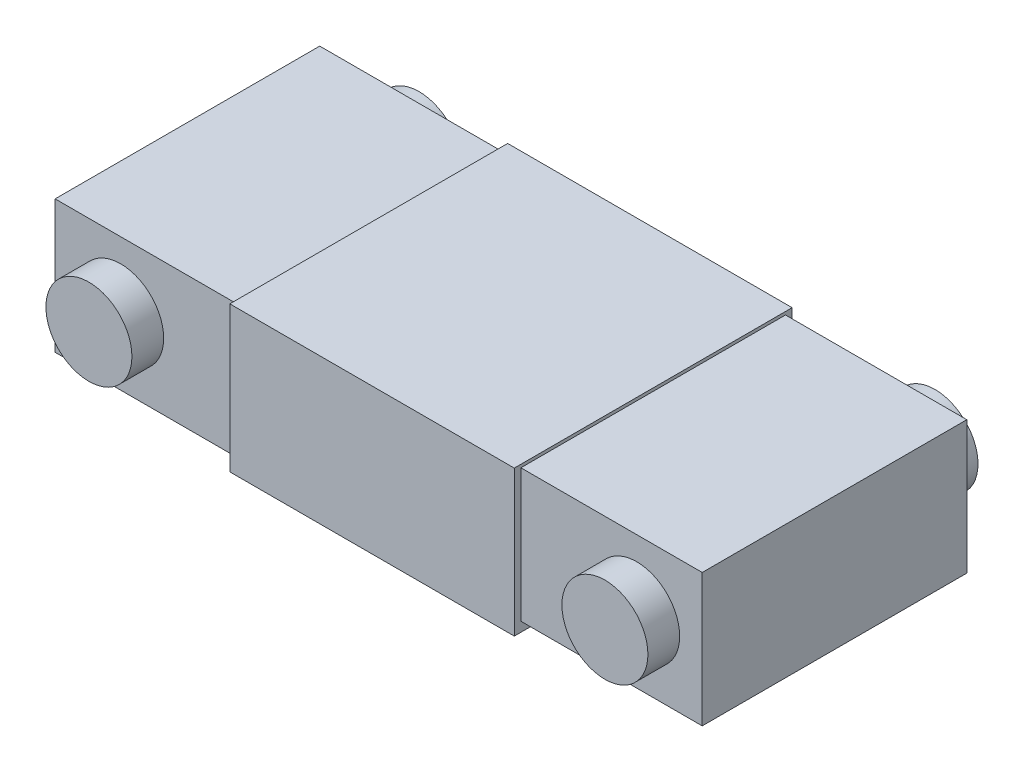
ISO-10303-21;
HEADER;
FILE_DESCRIPTION(('STEP AP214'),'2;1');
FILE_NAME('part.step','',(''),(''),'','','');
FILE_SCHEMA(('AUTOMOTIVE_DESIGN { 1 0 10303 214 1 1 1 1 }'));
ENDSEC;
DATA;
#1=APPLICATION_CONTEXT('core data for automotive mechanical design processes');
#2=APPLICATION_PROTOCOL_DEFINITION('international standard','automotive_design',2000,#1);
#3=PRODUCT_CONTEXT('',#1,'mechanical');
#4=PRODUCT('Part','Part','',(#3));
#5=PRODUCT_RELATED_PRODUCT_CATEGORY('part','',(#4));
#6=PRODUCT_DEFINITION_FORMATION('','',#4);
#7=PRODUCT_DEFINITION_CONTEXT('part definition',#1,'design');
#8=PRODUCT_DEFINITION('design','',#6,#7);
#9=PRODUCT_DEFINITION_SHAPE('','',#8);
#10=(LENGTH_UNIT() NAMED_UNIT(*) SI_UNIT(.MILLI.,.METRE.));
#11=(NAMED_UNIT(*) PLANE_ANGLE_UNIT() SI_UNIT($,.RADIAN.));
#12=(NAMED_UNIT(*) SI_UNIT($,.STERADIAN.) SOLID_ANGLE_UNIT());
#13=UNCERTAINTY_MEASURE_WITH_UNIT(LENGTH_MEASURE(1.E-05),#10,'distance_accuracy_value','');
#14=(GEOMETRIC_REPRESENTATION_CONTEXT(3) GLOBAL_UNCERTAINTY_ASSIGNED_CONTEXT((#13)) GLOBAL_UNIT_ASSIGNED_CONTEXT((#10,
#11,#12)) REPRESENTATION_CONTEXT('',''));
#15=CARTESIAN_POINT('',(0.,0.,0.));
#16=DIRECTION('',(0.,0.,1.));
#17=DIRECTION('',(1.,0.,0.));
#18=AXIS2_PLACEMENT_3D('',#15,#16,#17);
#19=CARTESIAN_POINT('',(0.,0.,20.));
#20=DIRECTION('',(0.,0.,1.));
#21=DIRECTION('',(1.,0.,0.));
#22=AXIS2_PLACEMENT_3D('',#19,#20,#21);
#23=PLANE('',#22);
#24=CARTESIAN_POINT('',(78.,0.,20.));
#25=DIRECTION('',(0.,0.,1.));
#26=DIRECTION('',(1.,0.,0.));
#27=AXIS2_PLACEMENT_3D('',#24,#25,#26);
#28=CIRCLE('',#27,6.5);
#29=CARTESIAN_POINT('',(84.5,0.,20.));
#30=VERTEX_POINT('',#29);
#31=EDGE_CURVE('E11',#30,#30,#28,.T.);
#32=ORIENTED_EDGE('',*,*,#31,.F.);
#33=EDGE_LOOP('',(#32));
#34=FACE_BOUND('',#33,.T.);
#35=DIRECTION('',(-1.,0.,0.));
#36=VECTOR('',#35,1.);
#37=CARTESIAN_POINT('',(87.91,10.045,20.));
#38=LINE('',#37,#36);
#39=CARTESIAN_POINT('',(87.91,10.045,20.));
#40=VERTEX_POINT('',#39);
#41=CARTESIAN_POINT('',(60.5,10.045,20.));
#42=VERTEX_POINT('',#41);
#43=EDGE_CURVE('E113',#40,#42,#38,.T.);
#44=ORIENTED_EDGE('',*,*,#43,.T.);
#45=DIRECTION('',(0.,-1.,0.));
#46=VECTOR('',#45,1.);
#47=CARTESIAN_POINT('',(60.5,0.,20.));
#48=LINE('',#47,#46);
#49=CARTESIAN_POINT('',(60.5,-10.045,20.));
#50=VERTEX_POINT('',#49);
#51=EDGE_CURVE('E116',#42,#50,#48,.T.);
#52=ORIENTED_EDGE('',*,*,#51,.T.);
#53=DIRECTION('',(1.,0.,0.));
#54=VECTOR('',#53,1.);
#55=CARTESIAN_POINT('',(87.91,-10.045,20.));
#56=LINE('',#55,#54);
#57=CARTESIAN_POINT('',(87.91,-10.045,20.));
#58=VERTEX_POINT('',#57);
#59=EDGE_CURVE('E157',#50,#58,#56,.T.);
#60=ORIENTED_EDGE('',*,*,#59,.T.);
#61=DIRECTION('',(0.,1.,0.));
#62=VECTOR('',#61,1.);
#63=CARTESIAN_POINT('',(87.91,10.045,20.));
#64=LINE('',#63,#62);
#65=EDGE_CURVE('E119',#58,#40,#64,.T.);
#66=ORIENTED_EDGE('',*,*,#65,.T.);
#67=EDGE_LOOP('',(#44,#52,#60,#66));
#68=FACE_BOUND('',#67,.T.);
#69=ADVANCED_FACE('F43',(#34,#68),#23,.T.);
#70=CARTESIAN_POINT('',(0.,0.,20.));
#71=DIRECTION('',(0.,0.,1.));
#72=DIRECTION('',(1.,0.,0.));
#73=AXIS2_PLACEMENT_3D('',#70,#71,#72);
#74=CIRCLE('',#73,6.5);
#75=CARTESIAN_POINT('',(6.5,0.,20.));
#76=VERTEX_POINT('',#75);
#77=EDGE_CURVE('E54',#76,#76,#74,.T.);
#78=ORIENTED_EDGE('',*,*,#77,.F.);
#79=EDGE_LOOP('',(#78));
#80=FACE_BOUND('',#79,.T.);
#81=DIRECTION('',(1.,0.,0.));
#82=VECTOR('',#81,1.);
#83=CARTESIAN_POINT('',(-9.91,-10.045,20.));
#84=LINE('',#83,#82);
#85=CARTESIAN_POINT('',(-9.91,-10.045,20.));
#86=VERTEX_POINT('',#85);
#87=CARTESIAN_POINT('',(17.5,-10.045,20.));
#88=VERTEX_POINT('',#87);
#89=EDGE_CURVE('E97',#86,#88,#84,.T.);
#90=ORIENTED_EDGE('',*,*,#89,.T.);
#91=DIRECTION('',(0.,1.,0.));
#92=VECTOR('',#91,1.);
#93=CARTESIAN_POINT('',(17.5,0.,20.));
#94=LINE('',#93,#92);
#95=CARTESIAN_POINT('',(17.5,10.045,20.));
#96=VERTEX_POINT('',#95);
#97=EDGE_CURVE('E141',#88,#96,#94,.T.);
#98=ORIENTED_EDGE('',*,*,#97,.T.);
#99=DIRECTION('',(-1.,0.,0.));
#100=VECTOR('',#99,1.);
#101=CARTESIAN_POINT('',(-9.91,10.045,20.));
#102=LINE('',#101,#100);
#103=CARTESIAN_POINT('',(-9.91,10.045,20.));
#104=VERTEX_POINT('',#103);
#105=EDGE_CURVE('E63',#96,#104,#102,.T.);
#106=ORIENTED_EDGE('',*,*,#105,.T.);
#107=DIRECTION('',(0.,-1.,0.));
#108=VECTOR('',#107,1.);
#109=CARTESIAN_POINT('',(-9.91,10.045,20.));
#110=LINE('',#109,#108);
#111=EDGE_CURVE('E152',#104,#86,#110,.T.);
#112=ORIENTED_EDGE('',*,*,#111,.T.);
#113=EDGE_LOOP('',(#90,#98,#106,#112));
#114=FACE_BOUND('',#113,.T.);
#115=ADVANCED_FACE('F318',(#80,#114),#23,.T.);
#116=CARTESIAN_POINT('',(0.,0.,-20.));
#117=DIRECTION('',(0.,0.,1.));
#118=DIRECTION('',(1.,0.,0.));
#119=AXIS2_PLACEMENT_3D('',#116,#117,#118);
#120=PLANE('',#119);
#121=CARTESIAN_POINT('',(78.,0.,-20.));
#122=DIRECTION('',(0.,0.,1.));
#123=DIRECTION('',(1.,0.,0.));
#124=AXIS2_PLACEMENT_3D('',#121,#122,#123);
#125=CIRCLE('',#124,6.5);
#126=CARTESIAN_POINT('',(84.5,0.,-20.));
#127=VERTEX_POINT('',#126);
#128=EDGE_CURVE('E47',#127,#127,#125,.T.);
#129=ORIENTED_EDGE('',*,*,#128,.T.);
#130=EDGE_LOOP('',(#129));
#131=FACE_BOUND('',#130,.T.);
#132=DIRECTION('',(0.,-1.,0.));
#133=VECTOR('',#132,1.);
#134=CARTESIAN_POINT('',(60.5,0.,-20.));
#135=LINE('',#134,#133);
#136=CARTESIAN_POINT('',(60.5,10.045,-20.));
#137=VERTEX_POINT('',#136);
#138=CARTESIAN_POINT('',(60.5,-10.045,-20.));
#139=VERTEX_POINT('',#138);
#140=EDGE_CURVE('E215',#137,#139,#135,.T.);
#141=ORIENTED_EDGE('',*,*,#140,.F.);
#142=DIRECTION('',(-1.,0.,0.));
#143=VECTOR('',#142,1.);
#144=CARTESIAN_POINT('',(87.91,10.045,-20.));
#145=LINE('',#144,#143);
#146=CARTESIAN_POINT('',(87.91,10.045,-20.));
#147=VERTEX_POINT('',#146);
#148=EDGE_CURVE('E128',#147,#137,#145,.T.);
#149=ORIENTED_EDGE('',*,*,#148,.F.);
#150=DIRECTION('',(0.,1.,0.));
#151=VECTOR('',#150,1.);
#152=CARTESIAN_POINT('',(87.91,10.045,-20.));
#153=LINE('',#152,#151);
#154=CARTESIAN_POINT('',(87.91,-10.045,-20.));
#155=VERTEX_POINT('',#154);
#156=EDGE_CURVE('E81',#155,#147,#153,.T.);
#157=ORIENTED_EDGE('',*,*,#156,.F.);
#158=DIRECTION('',(1.,0.,0.));
#159=VECTOR('',#158,1.);
#160=CARTESIAN_POINT('',(87.91,-10.045,-20.));
#161=LINE('',#160,#159);
#162=EDGE_CURVE('E168',#139,#155,#161,.T.);
#163=ORIENTED_EDGE('',*,*,#162,.F.);
#164=EDGE_LOOP('',(#141,#149,#157,#163));
#165=FACE_BOUND('',#164,.T.);
#166=ADVANCED_FACE('F302',(#131,#165),#120,.F.);
#167=CARTESIAN_POINT('',(0.,0.,-20.));
#168=DIRECTION('',(0.,0.,1.));
#169=DIRECTION('',(1.,0.,0.));
#170=AXIS2_PLACEMENT_3D('',#167,#168,#169);
#171=CIRCLE('',#170,6.5);
#172=CARTESIAN_POINT('',(6.5,0.,-20.));
#173=VERTEX_POINT('',#172);
#174=EDGE_CURVE('E217',#173,#173,#171,.T.);
#175=ORIENTED_EDGE('',*,*,#174,.T.);
#176=EDGE_LOOP('',(#175));
#177=FACE_BOUND('',#176,.T.);
#178=DIRECTION('',(0.,1.,0.));
#179=VECTOR('',#178,1.);
#180=CARTESIAN_POINT('',(17.5,0.,-20.));
#181=LINE('',#180,#179);
#182=CARTESIAN_POINT('',(17.5,-10.045,-20.));
#183=VERTEX_POINT('',#182);
#184=CARTESIAN_POINT('',(17.5,10.045,-20.));
#185=VERTEX_POINT('',#184);
#186=EDGE_CURVE('E211',#183,#185,#181,.T.);
#187=ORIENTED_EDGE('',*,*,#186,.F.);
#188=DIRECTION('',(1.,0.,0.));
#189=VECTOR('',#188,1.);
#190=CARTESIAN_POINT('',(-9.91,-10.045,-20.));
#191=LINE('',#190,#189);
#192=CARTESIAN_POINT('',(-9.91,-10.045,-20.));
#193=VERTEX_POINT('',#192);
#194=EDGE_CURVE('E146',#193,#183,#191,.T.);
#195=ORIENTED_EDGE('',*,*,#194,.F.);
#196=DIRECTION('',(0.,-1.,0.));
#197=VECTOR('',#196,1.);
#198=CARTESIAN_POINT('',(-9.91,10.045,-20.));
#199=LINE('',#198,#197);
#200=CARTESIAN_POINT('',(-9.91,10.045,-20.));
#201=VERTEX_POINT('',#200);
#202=EDGE_CURVE('E140',#201,#193,#199,.T.);
#203=ORIENTED_EDGE('',*,*,#202,.F.);
#204=DIRECTION('',(-1.,0.,0.));
#205=VECTOR('',#204,1.);
#206=CARTESIAN_POINT('',(-9.91,10.045,-20.));
#207=LINE('',#206,#205);
#208=EDGE_CURVE('E88',#185,#201,#207,.T.);
#209=ORIENTED_EDGE('',*,*,#208,.F.);
#210=EDGE_LOOP('',(#187,#195,#203,#209));
#211=FACE_BOUND('',#210,.T.);
#212=ADVANCED_FACE('F332',(#177,#211),#120,.F.);
#213=CARTESIAN_POINT('',(-9.91,10.045,20.));
#214=DIRECTION('',(1.,0.,0.));
#215=DIRECTION('',(0.,1.,0.));
#216=AXIS2_PLACEMENT_3D('',#213,#214,#215);
#217=PLANE('',#216);
#218=ORIENTED_EDGE('',*,*,#202,.T.);
#219=DIRECTION('',(0.,0.,-1.));
#220=VECTOR('',#219,1.);
#221=CARTESIAN_POINT('',(-9.91,-10.045,20.));
#222=LINE('',#221,#220);
#223=EDGE_CURVE('E208',#86,#193,#222,.T.);
#224=ORIENTED_EDGE('',*,*,#223,.F.);
#225=ORIENTED_EDGE('',*,*,#111,.F.);
#226=DIRECTION('',(0.,0.,-1.));
#227=VECTOR('',#226,1.);
#228=CARTESIAN_POINT('',(-9.91,10.045,20.));
#229=LINE('',#228,#227);
#230=EDGE_CURVE('E163',#104,#201,#229,.T.);
#231=ORIENTED_EDGE('',*,*,#230,.T.);
#232=EDGE_LOOP('',(#218,#224,#225,#231));
#233=FACE_BOUND('',#232,.T.);
#234=ADVANCED_FACE('F45',(#233),#217,.F.);
#235=CARTESIAN_POINT('',(-9.91,-10.045,20.));
#236=DIRECTION('',(0.,1.,0.));
#237=DIRECTION('',(-1.,0.,0.));
#238=AXIS2_PLACEMENT_3D('',#235,#236,#237);
#239=PLANE('',#238);
#240=ORIENTED_EDGE('',*,*,#194,.T.);
#241=DIRECTION('',(0.,0.,-1.));
#242=VECTOR('',#241,1.);
#243=CARTESIAN_POINT('',(17.5,-10.045,20.));
#244=LINE('',#243,#242);
#245=EDGE_CURVE('E204',#88,#183,#244,.T.);
#246=ORIENTED_EDGE('',*,*,#245,.F.);
#247=ORIENTED_EDGE('',*,*,#89,.F.);
#248=ORIENTED_EDGE('',*,*,#223,.T.);
#249=EDGE_LOOP('',(#240,#246,#247,#248));
#250=FACE_BOUND('',#249,.T.);
#251=ADVANCED_FACE('F497',(#250),#239,.F.);
#252=CARTESIAN_POINT('',(60.5,-11.495,20.));
#253=DIRECTION('',(0.,1.,0.));
#254=DIRECTION('',(-1.,0.,0.));
#255=AXIS2_PLACEMENT_3D('',#252,#253,#254);
#256=PLANE('',#255);
#257=DIRECTION('',(0.,0.,-1.));
#258=VECTOR('',#257,1.);
#259=CARTESIAN_POINT('',(17.5,-11.495,20.));
#260=LINE('',#259,#258);
#261=CARTESIAN_POINT('',(17.5,-11.495,21.));
#262=VERTEX_POINT('',#261);
#263=CARTESIAN_POINT('',(17.5,-11.495,-21.));
#264=VERTEX_POINT('',#263);
#265=EDGE_CURVE('E200',#262,#264,#260,.T.);
#266=ORIENTED_EDGE('',*,*,#265,.T.);
#267=DIRECTION('',(1.,0.,0.));
#268=VECTOR('',#267,1.);
#269=CARTESIAN_POINT('',(17.5,-11.495,-21.));
#270=LINE('',#269,#268);
#271=CARTESIAN_POINT('',(60.5,-11.495,-21.));
#272=VERTEX_POINT('',#271);
#273=EDGE_CURVE('E246',#264,#272,#270,.T.);
#274=ORIENTED_EDGE('',*,*,#273,.T.);
#275=DIRECTION('',(0.,0.,-1.));
#276=VECTOR('',#275,1.);
#277=CARTESIAN_POINT('',(60.5,-11.495,20.));
#278=LINE('',#277,#276);
#279=CARTESIAN_POINT('',(60.5,-11.495,21.));
#280=VERTEX_POINT('',#279);
#281=EDGE_CURVE('E196',#280,#272,#278,.T.);
#282=ORIENTED_EDGE('',*,*,#281,.F.);
#283=DIRECTION('',(1.,0.,0.));
#284=VECTOR('',#283,1.);
#285=CARTESIAN_POINT('',(17.5,-11.495,21.));
#286=LINE('',#285,#284);
#287=EDGE_CURVE('E148',#262,#280,#286,.T.);
#288=ORIENTED_EDGE('',*,*,#287,.F.);
#289=EDGE_LOOP('',(#266,#274,#282,#288));
#290=FACE_BOUND('',#289,.T.);
#291=ADVANCED_FACE('F270',(#290),#256,.F.);
#292=CARTESIAN_POINT('',(87.91,-10.045,20.));
#293=DIRECTION('',(0.,1.,0.));
#294=DIRECTION('',(-1.,0.,0.));
#295=AXIS2_PLACEMENT_3D('',#292,#293,#294);
#296=PLANE('',#295);
#297=ORIENTED_EDGE('',*,*,#162,.T.);
#298=DIRECTION('',(0.,0.,-1.));
#299=VECTOR('',#298,1.);
#300=CARTESIAN_POINT('',(87.91,-10.045,20.));
#301=LINE('',#300,#299);
#302=EDGE_CURVE('E191',#58,#155,#301,.T.);
#303=ORIENTED_EDGE('',*,*,#302,.F.);
#304=ORIENTED_EDGE('',*,*,#59,.F.);
#305=DIRECTION('',(0.,0.,-1.));
#306=VECTOR('',#305,1.);
#307=CARTESIAN_POINT('',(60.5,-10.045,20.));
#308=LINE('',#307,#306);
#309=EDGE_CURVE('E137',#50,#139,#308,.T.);
#310=ORIENTED_EDGE('',*,*,#309,.T.);
#311=EDGE_LOOP('',(#297,#303,#304,#310));
#312=FACE_BOUND('',#311,.T.);
#313=ADVANCED_FACE('F305',(#312),#296,.F.);
#314=CARTESIAN_POINT('',(87.91,10.045,20.));
#315=DIRECTION('',(-1.,0.,0.));
#316=DIRECTION('',(0.,-1.,0.));
#317=AXIS2_PLACEMENT_3D('',#314,#315,#316);
#318=PLANE('',#317);
#319=ORIENTED_EDGE('',*,*,#156,.T.);
#320=DIRECTION('',(0.,0.,-1.));
#321=VECTOR('',#320,1.);
#322=CARTESIAN_POINT('',(87.91,10.045,20.));
#323=LINE('',#322,#321);
#324=EDGE_CURVE('E132',#40,#147,#323,.T.);
#325=ORIENTED_EDGE('',*,*,#324,.F.);
#326=ORIENTED_EDGE('',*,*,#65,.F.);
#327=ORIENTED_EDGE('',*,*,#302,.T.);
#328=EDGE_LOOP('',(#319,#325,#326,#327));
#329=FACE_BOUND('',#328,.T.);
#330=ADVANCED_FACE('F306',(#329),#318,.F.);
#331=CARTESIAN_POINT('',(87.91,10.045,20.));
#332=DIRECTION('',(0.,-1.,0.));
#333=DIRECTION('',(1.,0.,0.));
#334=AXIS2_PLACEMENT_3D('',#331,#332,#333);
#335=PLANE('',#334);
#336=ORIENTED_EDGE('',*,*,#148,.T.);
#337=DIRECTION('',(0.,0.,-1.));
#338=VECTOR('',#337,1.);
#339=CARTESIAN_POINT('',(60.5,10.045,20.));
#340=LINE('',#339,#338);
#341=EDGE_CURVE('E125',#42,#137,#340,.T.);
#342=ORIENTED_EDGE('',*,*,#341,.F.);
#343=ORIENTED_EDGE('',*,*,#43,.F.);
#344=ORIENTED_EDGE('',*,*,#324,.T.);
#345=EDGE_LOOP('',(#336,#342,#343,#344));
#346=FACE_BOUND('',#345,.T.);
#347=ADVANCED_FACE('F126',(#346),#335,.F.);
#348=CARTESIAN_POINT('',(60.5,10.505,20.));
#349=DIRECTION('',(-1.,0.,0.));
#350=DIRECTION('',(0.,-1.,0.));
#351=AXIS2_PLACEMENT_3D('',#348,#349,#350);
#352=PLANE('',#351);
#353=DIRECTION('',(0.,0.,-1.));
#354=VECTOR('',#353,1.);
#355=CARTESIAN_POINT('',(60.5,10.505,20.));
#356=LINE('',#355,#354);
#357=CARTESIAN_POINT('',(60.5,10.505,21.));
#358=VERTEX_POINT('',#357);
#359=CARTESIAN_POINT('',(60.5,10.505,-21.));
#360=VERTEX_POINT('',#359);
#361=EDGE_CURVE('E133',#358,#360,#356,.T.);
#362=ORIENTED_EDGE('',*,*,#361,.F.);
#363=DIRECTION('',(0.,1.,0.));
#364=VECTOR('',#363,1.);
#365=CARTESIAN_POINT('',(60.5,-11.495,21.));
#366=LINE('',#365,#364);
#367=EDGE_CURVE('E241',#280,#358,#366,.T.);
#368=ORIENTED_EDGE('',*,*,#367,.F.);
#369=ORIENTED_EDGE('',*,*,#281,.T.);
#370=DIRECTION('',(0.,1.,0.));
#371=VECTOR('',#370,1.);
#372=CARTESIAN_POINT('',(60.5,-11.495,-21.));
#373=LINE('',#372,#371);
#374=EDGE_CURVE('E220',#272,#360,#373,.T.);
#375=ORIENTED_EDGE('',*,*,#374,.T.);
#376=EDGE_LOOP('',(#362,#368,#369,#375));
#377=FACE_BOUND('',#376,.T.);
#378=ORIENTED_EDGE('',*,*,#341,.T.);
#379=ORIENTED_EDGE('',*,*,#140,.T.);
#380=ORIENTED_EDGE('',*,*,#309,.F.);
#381=ORIENTED_EDGE('',*,*,#51,.F.);
#382=EDGE_LOOP('',(#378,#379,#380,#381));
#383=FACE_BOUND('',#382,.T.);
#384=ADVANCED_FACE('F135',(#377,#383),#352,.F.);
#385=CARTESIAN_POINT('',(60.5,10.505,20.));
#386=DIRECTION('',(0.,-1.,0.));
#387=DIRECTION('',(1.,0.,0.));
#388=AXIS2_PLACEMENT_3D('',#385,#386,#387);
#389=PLANE('',#388);
#390=ORIENTED_EDGE('',*,*,#361,.T.);
#391=DIRECTION('',(-1.,0.,0.));
#392=VECTOR('',#391,1.);
#393=CARTESIAN_POINT('',(60.5,10.505,-21.));
#394=LINE('',#393,#392);
#395=CARTESIAN_POINT('',(17.5,10.505,-21.));
#396=VERTEX_POINT('',#395);
#397=EDGE_CURVE('E227',#360,#396,#394,.T.);
#398=ORIENTED_EDGE('',*,*,#397,.T.);
#399=DIRECTION('',(0.,0.,-1.));
#400=VECTOR('',#399,1.);
#401=CARTESIAN_POINT('',(17.5,10.505,20.));
#402=LINE('',#401,#400);
#403=CARTESIAN_POINT('',(17.5,10.505,21.));
#404=VERTEX_POINT('',#403);
#405=EDGE_CURVE('E182',#404,#396,#402,.T.);
#406=ORIENTED_EDGE('',*,*,#405,.F.);
#407=DIRECTION('',(-1.,0.,0.));
#408=VECTOR('',#407,1.);
#409=CARTESIAN_POINT('',(60.5,10.505,21.));
#410=LINE('',#409,#408);
#411=EDGE_CURVE('E245',#358,#404,#410,.T.);
#412=ORIENTED_EDGE('',*,*,#411,.F.);
#413=EDGE_LOOP('',(#390,#398,#406,#412));
#414=FACE_BOUND('',#413,.T.);
#415=ADVANCED_FACE('F340',(#414),#389,.F.);
#416=CARTESIAN_POINT('',(17.5,10.505,20.));
#417=DIRECTION('',(1.,0.,0.));
#418=DIRECTION('',(0.,1.,0.));
#419=AXIS2_PLACEMENT_3D('',#416,#417,#418);
#420=PLANE('',#419);
#421=ORIENTED_EDGE('',*,*,#265,.F.);
#422=DIRECTION('',(0.,-1.,0.));
#423=VECTOR('',#422,1.);
#424=CARTESIAN_POINT('',(17.5,10.505,21.));
#425=LINE('',#424,#423);
#426=EDGE_CURVE('E250',#404,#262,#425,.T.);
#427=ORIENTED_EDGE('',*,*,#426,.F.);
#428=ORIENTED_EDGE('',*,*,#405,.T.);
#429=DIRECTION('',(0.,-1.,0.));
#430=VECTOR('',#429,1.);
#431=CARTESIAN_POINT('',(17.5,10.505,-21.));
#432=LINE('',#431,#430);
#433=EDGE_CURVE('E260',#396,#264,#432,.T.);
#434=ORIENTED_EDGE('',*,*,#433,.T.);
#435=EDGE_LOOP('',(#421,#427,#428,#434));
#436=FACE_BOUND('',#435,.T.);
#437=ORIENTED_EDGE('',*,*,#97,.F.);
#438=ORIENTED_EDGE('',*,*,#245,.T.);
#439=ORIENTED_EDGE('',*,*,#186,.T.);
#440=DIRECTION('',(0.,0.,-1.));
#441=VECTOR('',#440,1.);
#442=CARTESIAN_POINT('',(17.5,10.045,20.));
#443=LINE('',#442,#441);
#444=EDGE_CURVE('E179',#96,#185,#443,.T.);
#445=ORIENTED_EDGE('',*,*,#444,.F.);
#446=EDGE_LOOP('',(#437,#438,#439,#445));
#447=FACE_BOUND('',#446,.T.);
#448=ADVANCED_FACE('F337',(#436,#447),#420,.F.);
#449=CARTESIAN_POINT('',(-9.91,10.045,20.));
#450=DIRECTION('',(0.,-1.,0.));
#451=DIRECTION('',(0.,0.,-1.));
#452=AXIS2_PLACEMENT_3D('',#449,#450,#451);
#453=PLANE('',#452);
#454=ORIENTED_EDGE('',*,*,#208,.T.);
#455=ORIENTED_EDGE('',*,*,#230,.F.);
#456=ORIENTED_EDGE('',*,*,#105,.F.);
#457=ORIENTED_EDGE('',*,*,#444,.T.);
#458=EDGE_LOOP('',(#454,#455,#456,#457));
#459=FACE_BOUND('',#458,.T.);
#460=ADVANCED_FACE('F334',(#459),#453,.F.);
#461=CARTESIAN_POINT('',(0.,0.,-21.));
#462=DIRECTION('',(0.,0.,1.));
#463=DIRECTION('',(1.,0.,0.));
#464=AXIS2_PLACEMENT_3D('',#461,#462,#463);
#465=PLANE('',#464);
#466=ORIENTED_EDGE('',*,*,#374,.F.);
#467=ORIENTED_EDGE('',*,*,#273,.F.);
#468=ORIENTED_EDGE('',*,*,#433,.F.);
#469=ORIENTED_EDGE('',*,*,#397,.F.);
#470=EDGE_LOOP('',(#466,#467,#468,#469));
#471=FACE_BOUND('',#470,.T.);
#472=ADVANCED_FACE('F280',(#471),#465,.F.);
#473=CARTESIAN_POINT('',(0.,0.,21.));
#474=DIRECTION('',(0.,0.,1.));
#475=DIRECTION('',(1.,0.,0.));
#476=AXIS2_PLACEMENT_3D('',#473,#474,#475);
#477=PLANE('',#476);
#478=ORIENTED_EDGE('',*,*,#367,.T.);
#479=ORIENTED_EDGE('',*,*,#411,.T.);
#480=ORIENTED_EDGE('',*,*,#426,.T.);
#481=ORIENTED_EDGE('',*,*,#287,.T.);
#482=EDGE_LOOP('',(#478,#479,#480,#481));
#483=FACE_BOUND('',#482,.T.);
#484=ADVANCED_FACE('F365',(#483),#477,.T.);
#485=CARTESIAN_POINT('',(0.,0.,-25.1));
#486=DIRECTION('',(0.,0.,1.));
#487=DIRECTION('',(1.,0.,0.));
#488=AXIS2_PLACEMENT_3D('',#485,#486,#487);
#489=PLANE('',#488);
#490=CARTESIAN_POINT('',(0.,0.,-25.1));
#491=DIRECTION('',(0.,0.,1.));
#492=DIRECTION('',(1.,0.,0.));
#493=AXIS2_PLACEMENT_3D('',#490,#491,#492);
#494=CIRCLE('',#493,6.5);
#495=CARTESIAN_POINT('',(6.5,0.,-25.1));
#496=VERTEX_POINT('',#495);
#497=EDGE_CURVE('E221',#496,#496,#494,.T.);
#498=ORIENTED_EDGE('',*,*,#497,.F.);
#499=EDGE_LOOP('',(#498));
#500=FACE_BOUND('',#499,.T.);
#501=ADVANCED_FACE('F370',(#500),#489,.F.);
#502=CARTESIAN_POINT('',(0.,0.,-25.1));
#503=DIRECTION('',(0.,0.,1.));
#504=DIRECTION('',(1.,0.,0.));
#505=AXIS2_PLACEMENT_3D('',#502,#503,#504);
#506=CYLINDRICAL_SURFACE('',#505,6.5);
#507=ORIENTED_EDGE('',*,*,#497,.T.);
#508=EDGE_LOOP('',(#507));
#509=FACE_BOUND('',#508,.T.);
#510=ORIENTED_EDGE('',*,*,#174,.F.);
#511=EDGE_LOOP('',(#510));
#512=FACE_BOUND('',#511,.T.);
#513=ADVANCED_FACE('F377',(#509,#512),#506,.T.);
#514=ORIENTED_EDGE('',*,*,#77,.T.);
#515=EDGE_LOOP('',(#514));
#516=FACE_BOUND('',#515,.T.);
#517=CARTESIAN_POINT('',(0.,0.,24.8));
#518=DIRECTION('',(0.,0.,1.));
#519=DIRECTION('',(1.,0.,0.));
#520=AXIS2_PLACEMENT_3D('',#517,#518,#519);
#521=CIRCLE('',#520,6.5);
#522=CARTESIAN_POINT('',(6.5,0.,24.8));
#523=VERTEX_POINT('',#522);
#524=EDGE_CURVE('E230',#523,#523,#521,.T.);
#525=ORIENTED_EDGE('',*,*,#524,.F.);
#526=EDGE_LOOP('',(#525));
#527=FACE_BOUND('',#526,.T.);
#528=ADVANCED_FACE('F386',(#516,#527),#506,.T.);
#529=CARTESIAN_POINT('',(0.,0.,24.8));
#530=DIRECTION('',(0.,0.,1.));
#531=DIRECTION('',(1.,0.,0.));
#532=AXIS2_PLACEMENT_3D('',#529,#530,#531);
#533=PLANE('',#532);
#534=ORIENTED_EDGE('',*,*,#524,.T.);
#535=EDGE_LOOP('',(#534));
#536=FACE_BOUND('',#535,.T.);
#537=ADVANCED_FACE('F393',(#536),#533,.T.);
#538=CARTESIAN_POINT('',(78.,0.,-25.1));
#539=DIRECTION('',(0.,0.,-1.));
#540=DIRECTION('',(-1.,0.,0.));
#541=AXIS2_PLACEMENT_3D('',#538,#539,#540);
#542=PLANE('',#541);
#543=CARTESIAN_POINT('',(78.,0.,-25.1));
#544=DIRECTION('',(0.,0.,1.));
#545=DIRECTION('',(-1.,0.,0.));
#546=AXIS2_PLACEMENT_3D('',#543,#544,#545);
#547=CIRCLE('',#546,6.5);
#548=CARTESIAN_POINT('',(71.5,0.,-25.1));
#549=VERTEX_POINT('',#548);
#550=EDGE_CURVE('E600',#549,#549,#547,.T.);
#551=ORIENTED_EDGE('',*,*,#550,.F.);
#552=EDGE_LOOP('',(#551));
#553=FACE_BOUND('',#552,.T.);
#554=ADVANCED_FACE('F400',(#553),#542,.T.);
#555=CARTESIAN_POINT('',(78.,0.,-25.1));
#556=DIRECTION('',(0.,0.,1.));
#557=DIRECTION('',(1.,0.,0.));
#558=AXIS2_PLACEMENT_3D('',#555,#556,#557);
#559=CYLINDRICAL_SURFACE('',#558,6.5);
#560=ORIENTED_EDGE('',*,*,#550,.T.);
#561=EDGE_LOOP('',(#560));
#562=FACE_BOUND('',#561,.T.);
#563=ORIENTED_EDGE('',*,*,#128,.F.);
#564=EDGE_LOOP('',(#563));
#565=FACE_BOUND('',#564,.T.);
#566=ADVANCED_FACE('F408',(#562,#565),#559,.T.);
#567=ORIENTED_EDGE('',*,*,#31,.T.);
#568=EDGE_LOOP('',(#567));
#569=FACE_BOUND('',#568,.T.);
#570=CARTESIAN_POINT('',(78.,0.,24.8));
#571=DIRECTION('',(0.,0.,1.));
#572=DIRECTION('',(-1.,0.,0.));
#573=AXIS2_PLACEMENT_3D('',#570,#571,#572);
#574=CIRCLE('',#573,6.5);
#575=CARTESIAN_POINT('',(71.5,0.,24.8));
#576=VERTEX_POINT('',#575);
#577=EDGE_CURVE('E597',#576,#576,#574,.T.);
#578=ORIENTED_EDGE('',*,*,#577,.F.);
#579=EDGE_LOOP('',(#578));
#580=FACE_BOUND('',#579,.T.);
#581=ADVANCED_FACE('F416',(#569,#580),#559,.T.);
#582=CARTESIAN_POINT('',(78.,0.,24.8));
#583=DIRECTION('',(0.,0.,-1.));
#584=DIRECTION('',(-1.,0.,0.));
#585=AXIS2_PLACEMENT_3D('',#582,#583,#584);
#586=PLANE('',#585);
#587=ORIENTED_EDGE('',*,*,#577,.T.);
#588=EDGE_LOOP('',(#587));
#589=FACE_BOUND('',#588,.T.);
#590=ADVANCED_FACE('F424',(#589),#586,.F.);
#591=CLOSED_SHELL('',(#69,#115,#166,#212,#234,#251,#291,#313,#330,#347,#384,#415,#448,#460,#472,
#484,#501,#513,#528,#537,#554,#566,#581,#590));
#592=MANIFOLD_SOLID_BREP('B2',#591);
#593=ADVANCED_BREP_SHAPE_REPRESENTATION('',(#18,#592),#14);
#594=SHAPE_DEFINITION_REPRESENTATION(#9,#593);
ENDSEC;
END-ISO-10303-21;
